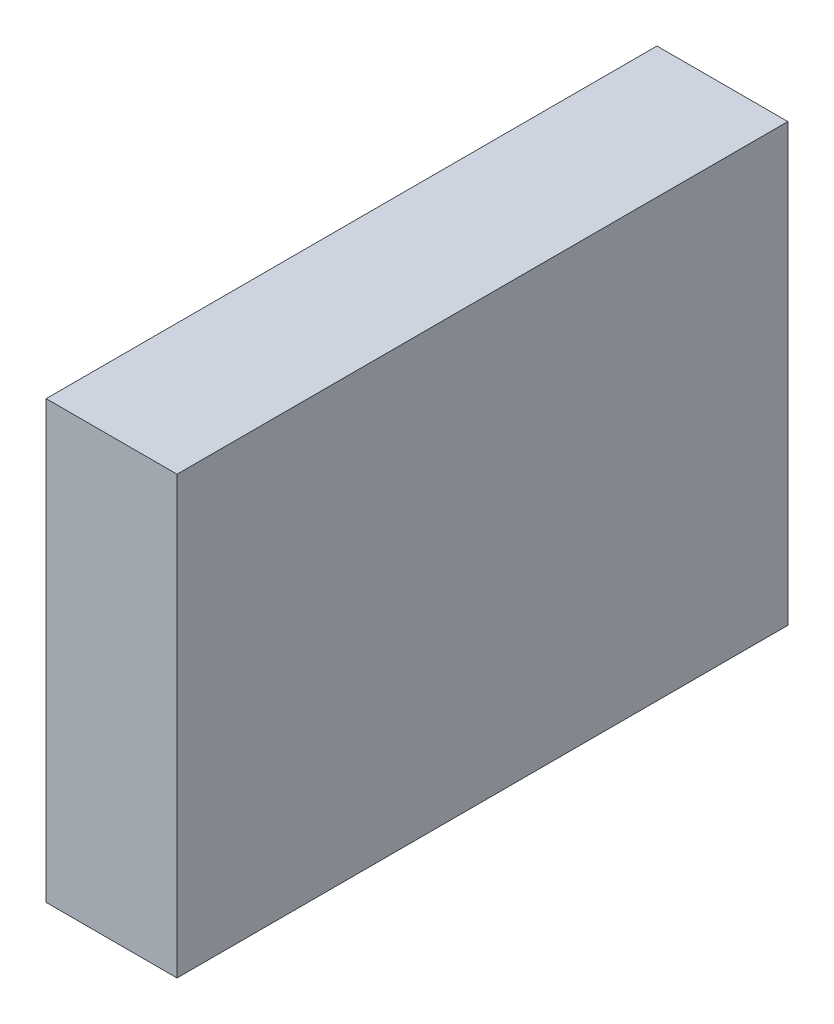
ISO-10303-21;
HEADER;
FILE_DESCRIPTION(('STEP AP214'),'2;1');
FILE_NAME('part.step','',(''),(''),'','','');
FILE_SCHEMA(('AUTOMOTIVE_DESIGN { 1 0 10303 214 1 1 1 1 }'));
ENDSEC;
DATA;
#1=APPLICATION_CONTEXT('core data for automotive mechanical design processes');
#2=APPLICATION_PROTOCOL_DEFINITION('international standard','automotive_design',2000,#1);
#3=PRODUCT_CONTEXT('',#1,'mechanical');
#4=PRODUCT('Part','Part','',(#3));
#5=PRODUCT_RELATED_PRODUCT_CATEGORY('part','',(#4));
#6=PRODUCT_DEFINITION_FORMATION('','',#4);
#7=PRODUCT_DEFINITION_CONTEXT('part definition',#1,'design');
#8=PRODUCT_DEFINITION('design','',#6,#7);
#9=PRODUCT_DEFINITION_SHAPE('','',#8);
#10=(LENGTH_UNIT() NAMED_UNIT(*) SI_UNIT(.MILLI.,.METRE.));
#11=(NAMED_UNIT(*) PLANE_ANGLE_UNIT() SI_UNIT($,.RADIAN.));
#12=(NAMED_UNIT(*) SI_UNIT($,.STERADIAN.) SOLID_ANGLE_UNIT());
#13=UNCERTAINTY_MEASURE_WITH_UNIT(LENGTH_MEASURE(1.E-05),#10,'distance_accuracy_value','');
#14=(GEOMETRIC_REPRESENTATION_CONTEXT(3) GLOBAL_UNCERTAINTY_ASSIGNED_CONTEXT((#13)) GLOBAL_UNIT_ASSIGNED_CONTEXT((#10,
#11,#12)) REPRESENTATION_CONTEXT('',''));
#15=CARTESIAN_POINT('',(0.,0.,0.));
#16=DIRECTION('',(0.,0.,1.));
#17=DIRECTION('',(1.,0.,0.));
#18=AXIS2_PLACEMENT_3D('',#15,#16,#17);
#19=CARTESIAN_POINT('',(3.,0.679999822530764,-3.72112146154861));
#20=DIRECTION('',(1.,0.,0.));
#21=DIRECTION('',(0.,1.,8.74227765734759E-08));
#22=AXIS2_PLACEMENT_3D('',#19,#20,#21);
#23=PLANE('',#22);
#24=DIRECTION('',(0.,8.74227765576152E-08,-0.999999999999996));
#25=VECTOR('',#24,1.);
#26=CARTESIAN_POINT('',(3.,0.749999694018282,-2.25112145542901));
#27=LINE('',#26,#25);
#28=CARTESIAN_POINT('',(3.,0.749999694018282,-2.25112145543001));
#29=VERTEX_POINT('',#28);
#30=CARTESIAN_POINT('',(3.,0.749999816411169,-3.65112145542901));
#31=VERTEX_POINT('',#30);
#32=EDGE_CURVE('E11',#29,#31,#27,.T.);
#33=ORIENTED_EDGE('',*,*,#32,.F.);
#34=DIRECTION('',(0.,-0.999999999999996,-8.74227765733007E-08));
#35=VECTOR('',#34,1.);
#36=CARTESIAN_POINT('',(3.,1.74999969402028,-2.25112136800623));
#37=LINE('',#36,#35);
#38=CARTESIAN_POINT('',(3.,1.74999969401928,-2.25112136800623));
#39=VERTEX_POINT('',#38);
#40=EDGE_CURVE('E59',#39,#29,#37,.T.);
#41=ORIENTED_EDGE('',*,*,#40,.F.);
#42=DIRECTION('',(0.,-8.74227766369168E-08,0.999999999999996));
#43=VECTOR('',#42,1.);
#44=CARTESIAN_POINT('',(3.,1.74999981641217,-3.65112136800624));
#45=LINE('',#44,#43);
#46=CARTESIAN_POINT('',(3.,1.74999981641217,-3.65112136800523));
#47=VERTEX_POINT('',#46);
#48=EDGE_CURVE('E79',#47,#39,#45,.T.);
#49=ORIENTED_EDGE('',*,*,#48,.F.);
#50=DIRECTION('',(0.,0.999999999999996,8.74227765733007E-08));
#51=VECTOR('',#50,1.);
#52=CARTESIAN_POINT('',(3.,0.749999816410169,-3.65112145542901));
#53=LINE('',#52,#51);
#54=EDGE_CURVE('E84',#31,#47,#53,.T.);
#55=ORIENTED_EDGE('',*,*,#54,.F.);
#56=EDGE_LOOP('',(#33,#41,#49,#55));
#57=FACE_BOUND('',#56,.T.);
#58=ADVANCED_FACE('F17',(#57),#23,.F.);
#59=CARTESIAN_POINT('',(3.3,0.679999822530764,-3.72112146154861));
#60=DIRECTION('',(1.,0.,0.));
#61=DIRECTION('',(0.,1.,8.74227765734759E-08));
#62=AXIS2_PLACEMENT_3D('',#59,#60,#61);
#63=PLANE('',#62);
#64=DIRECTION('',(0.,0.999999999999996,8.74227765733007E-08));
#65=VECTOR('',#64,1.);
#66=CARTESIAN_POINT('',(3.3,0.749999816410169,-3.65112145542901));
#67=LINE('',#66,#65);
#68=CARTESIAN_POINT('',(3.3,0.749999816411169,-3.65112145542901));
#69=VERTEX_POINT('',#68);
#70=CARTESIAN_POINT('',(3.3,1.74999981641217,-3.65112136800523));
#71=VERTEX_POINT('',#70);
#72=EDGE_CURVE('E24',#69,#71,#67,.T.);
#73=ORIENTED_EDGE('',*,*,#72,.T.);
#74=DIRECTION('',(0.,-8.74227764783136E-08,0.999999999999996));
#75=VECTOR('',#74,1.);
#76=CARTESIAN_POINT('',(3.3,1.74999981641217,-3.65112136800623));
#77=LINE('',#76,#75);
#78=CARTESIAN_POINT('',(3.3,1.74999969401928,-2.25112136800623));
#79=VERTEX_POINT('',#78);
#80=EDGE_CURVE('E82',#71,#79,#77,.T.);
#81=ORIENTED_EDGE('',*,*,#80,.T.);
#82=DIRECTION('',(0.,-0.999999999999996,-8.74227765733007E-08));
#83=VECTOR('',#82,1.);
#84=CARTESIAN_POINT('',(3.3,1.74999969402028,-2.25112136800623));
#85=LINE('',#84,#83);
#86=CARTESIAN_POINT('',(3.3,0.749999694018282,-2.25112145543001));
#87=VERTEX_POINT('',#86);
#88=EDGE_CURVE('E64',#79,#87,#85,.T.);
#89=ORIENTED_EDGE('',*,*,#88,.T.);
#90=DIRECTION('',(0.,8.74227765576152E-08,-0.999999999999996));
#91=VECTOR('',#90,1.);
#92=CARTESIAN_POINT('',(3.3,0.749999694018282,-2.25112145542901));
#93=LINE('',#92,#91);
#94=EDGE_CURVE('E61',#87,#69,#93,.T.);
#95=ORIENTED_EDGE('',*,*,#94,.T.);
#96=EDGE_LOOP('',(#73,#81,#89,#95));
#97=FACE_BOUND('',#96,.T.);
#98=ADVANCED_FACE('F62',(#97),#63,.T.);
#99=CARTESIAN_POINT('',(3.,0.749999816410169,-3.65112145542901));
#100=DIRECTION('',(0.,8.74227765734759E-08,-1.));
#101=DIRECTION('',(0.,1.,8.74227765734759E-08));
#102=AXIS2_PLACEMENT_3D('',#99,#100,#101);
#103=PLANE('',#102);
#104=ORIENTED_EDGE('',*,*,#54,.T.);
#105=DIRECTION('',(1.,0.,0.));
#106=VECTOR('',#105,1.);
#107=CARTESIAN_POINT('',(3.,1.74999981641217,-3.65112136800623));
#108=LINE('',#107,#106);
#109=EDGE_CURVE('E57',#47,#71,#108,.T.);
#110=ORIENTED_EDGE('',*,*,#109,.T.);
#111=ORIENTED_EDGE('',*,*,#72,.F.);
#112=DIRECTION('',(1.,0.,0.));
#113=VECTOR('',#112,1.);
#114=CARTESIAN_POINT('',(3.,0.749999816410169,-3.65112145542901));
#115=LINE('',#114,#113);
#116=EDGE_CURVE('E55',#31,#69,#115,.T.);
#117=ORIENTED_EDGE('',*,*,#116,.F.);
#118=EDGE_LOOP('',(#104,#110,#111,#117));
#119=FACE_BOUND('',#118,.T.);
#120=ADVANCED_FACE('F53',(#119),#103,.T.);
#121=CARTESIAN_POINT('',(3.,1.74999981641217,-3.65112136800623));
#122=DIRECTION('',(0.,1.,8.74227765734759E-08));
#123=DIRECTION('',(0.,-8.74227765734759E-08,1.));
#124=AXIS2_PLACEMENT_3D('',#121,#122,#123);
#125=PLANE('',#124);
#126=ORIENTED_EDGE('',*,*,#48,.T.);
#127=DIRECTION('',(1.,0.,0.));
#128=VECTOR('',#127,1.);
#129=CARTESIAN_POINT('',(3.,1.74999969402028,-2.25112136800623));
#130=LINE('',#129,#128);
#131=EDGE_CURVE('E68',#39,#79,#130,.T.);
#132=ORIENTED_EDGE('',*,*,#131,.T.);
#133=ORIENTED_EDGE('',*,*,#80,.F.);
#134=ORIENTED_EDGE('',*,*,#109,.F.);
#135=EDGE_LOOP('',(#126,#132,#133,#134));
#136=FACE_BOUND('',#135,.T.);
#137=ADVANCED_FACE('F91',(#136),#125,.T.);
#138=CARTESIAN_POINT('',(3.,1.74999969402028,-2.25112136800623));
#139=DIRECTION('',(0.,-8.74227765734759E-08,1.));
#140=DIRECTION('',(0.,-1.,-8.74227765734759E-08));
#141=AXIS2_PLACEMENT_3D('',#138,#139,#140);
#142=PLANE('',#141);
#143=ORIENTED_EDGE('',*,*,#40,.T.);
#144=DIRECTION('',(1.,0.,0.));
#145=VECTOR('',#144,1.);
#146=CARTESIAN_POINT('',(3.,0.749999694018282,-2.25112145542901));
#147=LINE('',#146,#145);
#148=EDGE_CURVE('E69',#29,#87,#147,.T.);
#149=ORIENTED_EDGE('',*,*,#148,.T.);
#150=ORIENTED_EDGE('',*,*,#88,.F.);
#151=ORIENTED_EDGE('',*,*,#131,.F.);
#152=EDGE_LOOP('',(#143,#149,#150,#151));
#153=FACE_BOUND('',#152,.T.);
#154=ADVANCED_FACE('F88',(#153),#142,.T.);
#155=CARTESIAN_POINT('',(3.,0.749999694018282,-2.25112145542901));
#156=DIRECTION('',(0.,-1.,-8.74227765734759E-08));
#157=DIRECTION('',(0.,8.74227765734759E-08,-1.));
#158=AXIS2_PLACEMENT_3D('',#155,#156,#157);
#159=PLANE('',#158);
#160=ORIENTED_EDGE('',*,*,#32,.T.);
#161=ORIENTED_EDGE('',*,*,#116,.T.);
#162=ORIENTED_EDGE('',*,*,#94,.F.);
#163=ORIENTED_EDGE('',*,*,#148,.F.);
#164=EDGE_LOOP('',(#160,#161,#162,#163));
#165=FACE_BOUND('',#164,.T.);
#166=ADVANCED_FACE('F71',(#165),#159,.T.);
#167=CLOSED_SHELL('',(#58,#98,#120,#137,#154,#166));
#168=MANIFOLD_SOLID_BREP('B1',#167);
#169=ADVANCED_BREP_SHAPE_REPRESENTATION('',(#18,#168),#14);
#170=SHAPE_DEFINITION_REPRESENTATION(#9,#169);
ENDSEC;
END-ISO-10303-21;
